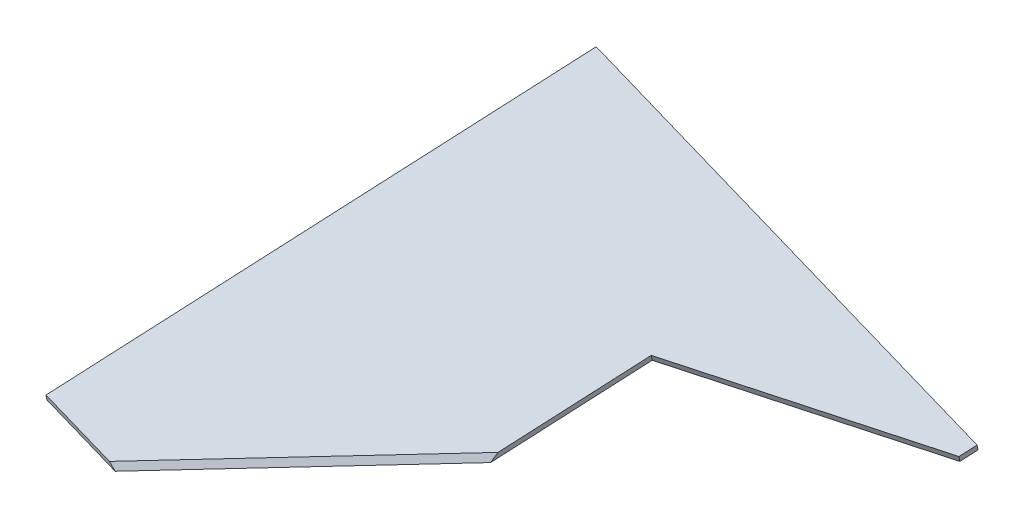
ISO-10303-21;
HEADER;
FILE_DESCRIPTION(('STEP AP214'),'2;1');
FILE_NAME('part.step','',(''),(''),'','','');
FILE_SCHEMA(('AUTOMOTIVE_DESIGN { 1 0 10303 214 1 1 1 1 }'));
ENDSEC;
DATA;
#1=APPLICATION_CONTEXT('core data for automotive mechanical design processes');
#2=APPLICATION_PROTOCOL_DEFINITION('international standard','automotive_design',2000,#1);
#3=PRODUCT_CONTEXT('',#1,'mechanical');
#4=PRODUCT('Part','Part','',(#3));
#5=PRODUCT_RELATED_PRODUCT_CATEGORY('part','',(#4));
#6=PRODUCT_DEFINITION_FORMATION('','',#4);
#7=PRODUCT_DEFINITION_CONTEXT('part definition',#1,'design');
#8=PRODUCT_DEFINITION('design','',#6,#7);
#9=PRODUCT_DEFINITION_SHAPE('','',#8);
#10=(LENGTH_UNIT() NAMED_UNIT(*) SI_UNIT(.MILLI.,.METRE.));
#11=(NAMED_UNIT(*) PLANE_ANGLE_UNIT() SI_UNIT($,.RADIAN.));
#12=(NAMED_UNIT(*) SI_UNIT($,.STERADIAN.) SOLID_ANGLE_UNIT());
#13=UNCERTAINTY_MEASURE_WITH_UNIT(LENGTH_MEASURE(1.E-05),#10,'distance_accuracy_value','');
#14=(GEOMETRIC_REPRESENTATION_CONTEXT(3) GLOBAL_UNCERTAINTY_ASSIGNED_CONTEXT((#13)) GLOBAL_UNIT_ASSIGNED_CONTEXT((#10,
#11,#12)) REPRESENTATION_CONTEXT('',''));
#15=CARTESIAN_POINT('',(0.,0.,0.));
#16=DIRECTION('',(0.,0.,1.));
#17=DIRECTION('',(1.,0.,0.));
#18=AXIS2_PLACEMENT_3D('',#15,#16,#17);
#19=CARTESIAN_POINT('',(-33.7903082011656,364.512306045971,252.100637317166));
#20=DIRECTION('',(-0.97245536084359,0.169146641830464,-0.160374513947948));
#21=DIRECTION('',(-0.171364746471442,-0.985207655099562,0.));
#22=AXIS2_PLACEMENT_3D('',#19,#20,#21);
#23=PLANE('',#22);
#24=DIRECTION('',(0.200452709124791,0.255754847030097,-0.945731552622172));
#25=VECTOR('',#24,1.);
#26=CARTESIAN_POINT('',(-34.1471604719162,361.656818373786,251.252789093214));
#27=LINE('',#26,#25);
#28=CARTESIAN_POINT('',(-34.1471604719162,361.656818373786,251.252789093214));
#29=VERTEX_POINT('',#28);
#30=CARTESIAN_POINT('',(16.6532138889619,426.4723154078,11.5777199566262));
#31=VERTEX_POINT('',#30);
#32=EDGE_CURVE('E134',#29,#31,#27,.T.);
#33=ORIENTED_EDGE('',*,*,#32,.F.);
#34=DIRECTION('',(-0.118950756916867,-0.9518292240618,-0.282616074650427));
#35=VECTOR('',#34,1.);
#36=CARTESIAN_POINT('',(-33.7903082011656,364.512306045971,252.100637317166));
#37=LINE('',#36,#35);
#38=CARTESIAN_POINT('',(-33.7903082011656,364.512306045971,252.100637317166));
#39=VERTEX_POINT('',#38);
#40=EDGE_CURVE('E40',#39,#29,#37,.T.);
#41=ORIENTED_EDGE('',*,*,#40,.F.);
#42=DIRECTION('',(0.200452709124791,0.255754847030097,-0.945731552622172));
#43=VECTOR('',#42,1.);
#44=CARTESIAN_POINT('',(-33.7903082011656,364.512306045971,252.100637317166));
#45=LINE('',#44,#43);
#46=CARTESIAN_POINT('',(17.0100661597125,429.327803079985,12.4255681805774));
#47=VERTEX_POINT('',#46);
#48=EDGE_CURVE('E103',#39,#47,#45,.T.);
#49=ORIENTED_EDGE('',*,*,#48,.T.);
#50=DIRECTION('',(-0.118950756916867,-0.9518292240618,-0.282616074650427));
#51=VECTOR('',#50,1.);
#52=CARTESIAN_POINT('',(17.0100661597125,429.327803079985,12.4255681805774));
#53=LINE('',#52,#51);
#54=EDGE_CURVE('E97',#47,#31,#53,.T.);
#55=ORIENTED_EDGE('',*,*,#54,.T.);
#56=EDGE_LOOP('',(#33,#41,#49,#55));
#57=FACE_BOUND('',#56,.T.);
#58=ADVANCED_FACE('F33',(#57),#23,.T.);
#59=CARTESIAN_POINT('',(-33.7903082011656,364.512306045971,252.100637317166));
#60=DIRECTION('',(-0.200452709124791,-0.255754847030097,0.945731552622172));
#61=DIRECTION('',(0.,-0.965324375324192,-0.261053347814119));
#62=AXIS2_PLACEMENT_3D('',#59,#60,#61);
#63=PLANE('',#62);
#64=DIRECTION('',(0.615073227817233,-0.784224664521137,-0.081710464318843));
#65=VECTOR('',#64,1.);
#66=CARTESIAN_POINT('',(-11.8843363994602,380.751963847055,261.135423739073));
#67=LINE('',#66,#65);
#68=CARTESIAN_POINT('',(6.32511948565873,357.534721107848,258.716357149804));
#69=VERTEX_POINT('',#68);
#70=CARTESIAN_POINT('',(8.9748610828492,354.156273435042,258.364347654935));
#71=VERTEX_POINT('',#70);
#72=EDGE_CURVE('E54',#69,#71,#67,.T.);
#73=ORIENTED_EDGE('',*,*,#72,.F.);
#74=DIRECTION('',(-0.97245536084359,0.169146641830464,-0.160374513947948));
#75=VECTOR('',#74,1.);
#76=CARTESIAN_POINT('',(-33.7903082011656,364.512306045971,252.100637317166));
#77=LINE('',#76,#75);
#78=EDGE_CURVE('E138',#69,#39,#77,.T.);
#79=ORIENTED_EDGE('',*,*,#78,.T.);
#80=ORIENTED_EDGE('',*,*,#40,.T.);
#81=DIRECTION('',(-0.97245536084359,0.169146641830464,-0.160374513947948));
#82=VECTOR('',#81,1.);
#83=CARTESIAN_POINT('',(-34.1471604719162,361.656818373786,251.252789093214));
#84=LINE('',#83,#82);
#85=EDGE_CURVE('E135',#71,#29,#84,.T.);
#86=ORIENTED_EDGE('',*,*,#85,.F.);
#87=EDGE_LOOP('',(#73,#79,#80,#86));
#88=FACE_BOUND('',#87,.T.);
#89=ADVANCED_FACE('F155',(#88),#63,.T.);
#90=CARTESIAN_POINT('',(95.5462547910566,342.015802682515,273.430447672247));
#91=DIRECTION('',(0.97245536084359,-0.169146641830464,0.160374513947948));
#92=DIRECTION('',(0.171364746471442,0.985207655099562,0.));
#93=AXIS2_PLACEMENT_3D('',#90,#91,#92);
#94=PLANE('',#93);
#95=DIRECTION('',(-0.118950756916867,-0.9518292240618,-0.282616074650427));
#96=VECTOR('',#95,1.);
#97=CARTESIAN_POINT('',(132.537914934905,389.212951689813,98.9045939950377));
#98=LINE('',#97,#96);
#99=CARTESIAN_POINT('',(132.537914934905,389.212951689813,98.9045939950377));
#100=VERTEX_POINT('',#99);
#101=CARTESIAN_POINT('',(132.181062664155,386.357464017628,98.0567457710864));
#102=VERTEX_POINT('',#101);
#103=EDGE_CURVE('E47',#100,#102,#98,.T.);
#104=ORIENTED_EDGE('',*,*,#103,.F.);
#105=DIRECTION('',(-0.200452709124791,-0.255754847030097,0.945731552622172));
#106=VECTOR('',#105,1.);
#107=CARTESIAN_POINT('',(95.5462547910566,342.015802682515,273.430447672247));
#108=LINE('',#107,#106);
#109=CARTESIAN_POINT('',(118.387318654633,371.15840105367,165.66680164542));
#110=VERTEX_POINT('',#109);
#111=EDGE_CURVE('E102',#100,#110,#108,.T.);
#112=ORIENTED_EDGE('',*,*,#111,.T.);
#113=DIRECTION('',(0.231192288874478,0.787542154090724,-0.571250804021423));
#114=VECTOR('',#113,1.);
#115=CARTESIAN_POINT('',(97.628153371008,300.443595537523,216.960423577262));
#116=LINE('',#115,#114);
#117=CARTESIAN_POINT('',(117.260763080799,367.320859552438,168.450396982708));
#118=VERTEX_POINT('',#117);
#119=EDGE_CURVE('E126',#118,#110,#116,.T.);
#120=ORIENTED_EDGE('',*,*,#119,.F.);
#121=DIRECTION('',(-0.200452709124791,-0.255754847030097,0.945731552622172));
#122=VECTOR('',#121,1.);
#123=CARTESIAN_POINT('',(95.189402520306,339.16031501033,272.582599448296));
#124=LINE('',#123,#122);
#125=EDGE_CURVE('E144',#102,#118,#124,.T.);
#126=ORIENTED_EDGE('',*,*,#125,.F.);
#127=EDGE_LOOP('',(#104,#112,#120,#126));
#128=FACE_BOUND('',#127,.T.);
#129=ADVANCED_FACE('F158',(#128),#94,.T.);
#130=CARTESIAN_POINT('',(17.0100661597125,429.327803079985,12.4255681805774));
#131=DIRECTION('',(0.200452709124791,0.255754847030097,-0.945731552622172));
#132=DIRECTION('',(0.,0.965324375324192,0.261053347814119));
#133=AXIS2_PLACEMENT_3D('',#130,#131,#132);
#134=PLANE('',#133);
#135=DIRECTION('',(0.97245536084359,-0.169146641830463,0.160374513947948));
#136=VECTOR('',#135,1.);
#137=CARTESIAN_POINT('',(16.6532138889619,426.4723154078,11.5777199566262));
#138=LINE('',#137,#136);
#139=CARTESIAN_POINT('',(257.433161233811,384.591606890581,51.2864496101342));
#140=VERTEX_POINT('',#139);
#141=EDGE_CURVE('E142',#31,#140,#138,.T.);
#142=ORIENTED_EDGE('',*,*,#141,.F.);
#143=ORIENTED_EDGE('',*,*,#54,.F.);
#144=DIRECTION('',(0.97245536084359,-0.169146641830463,0.160374513947948));
#145=VECTOR('',#144,1.);
#146=CARTESIAN_POINT('',(17.0100661597125,429.327803079985,12.4255681805774));
#147=LINE('',#146,#145);
#148=CARTESIAN_POINT('',(257.790013504561,387.447094562767,52.1342978340855));
#149=VERTEX_POINT('',#148);
#150=EDGE_CURVE('E91',#47,#149,#147,.T.);
#151=ORIENTED_EDGE('',*,*,#150,.T.);
#152=DIRECTION('',(-0.118950756916867,-0.9518292240618,-0.282616074650427));
#153=VECTOR('',#152,1.);
#154=CARTESIAN_POINT('',(257.790013504561,387.447094562767,52.1342978340855));
#155=LINE('',#154,#153);
#156=EDGE_CURVE('E95',#149,#140,#155,.T.);
#157=ORIENTED_EDGE('',*,*,#156,.T.);
#158=EDGE_LOOP('',(#142,#143,#151,#157));
#159=FACE_BOUND('',#158,.T.);
#160=ADVANCED_FACE('F94',(#159),#134,.T.);
#161=CARTESIAN_POINT('',(49.2672356639689,394.230317731218,117.05442750532));
#162=DIRECTION('',(-0.118950756916867,-0.9518292240618,-0.282616074650427));
#163=DIRECTION('',(0.,0.284636952950701,-0.958635386898971));
#164=AXIS2_PLACEMENT_3D('',#161,#162,#163);
#165=PLANE('',#164);
#166=ORIENTED_EDGE('',*,*,#78,.F.);
#167=DIRECTION('',(0.766009907789521,0.0931257274660205,-0.636047498267397));
#168=VECTOR('',#167,1.);
#169=CARTESIAN_POINT('',(103.160343585347,369.307219866567,178.310344895335));
#170=LINE('',#169,#168);
#171=EDGE_CURVE('E131',#69,#110,#170,.T.);
#172=ORIENTED_EDGE('',*,*,#171,.T.);
#173=ORIENTED_EDGE('',*,*,#111,.F.);
#174=DIRECTION('',(-0.953480406796191,0.0300966303353339,0.299948840134829));
#175=VECTOR('',#174,1.);
#176=CARTESIAN_POINT('',(256.116736436895,385.312183429122,60.028782902808));
#177=LINE('',#176,#175);
#178=CARTESIAN_POINT('',(256.116736436895,385.312183429122,60.028782902808));
#179=VERTEX_POINT('',#178);
#180=EDGE_CURVE('E117',#179,#100,#177,.T.);
#181=ORIENTED_EDGE('',*,*,#180,.F.);
#182=DIRECTION('',(-0.200452709124791,-0.255754847030095,0.945731552622172));
#183=VECTOR('',#182,1.);
#184=CARTESIAN_POINT('',(257.790013504561,387.447094562767,52.1342978340855));
#185=LINE('',#184,#183);
#186=EDGE_CURVE('E108',#149,#179,#185,.T.);
#187=ORIENTED_EDGE('',*,*,#186,.F.);
#188=ORIENTED_EDGE('',*,*,#150,.F.);
#189=ORIENTED_EDGE('',*,*,#48,.F.);
#190=EDGE_LOOP('',(#166,#172,#173,#181,#187,#188,#189));
#191=FACE_BOUND('',#190,.T.);
#192=ADVANCED_FACE('F115',(#191),#165,.F.);
#193=CARTESIAN_POINT('',(48.9103833932183,391.374830059033,116.206579281369));
#194=DIRECTION('',(-0.118950756916867,-0.9518292240618,-0.282616074650427));
#195=DIRECTION('',(0.,0.284636952950701,-0.958635386898971));
#196=AXIS2_PLACEMENT_3D('',#193,#194,#195);
#197=PLANE('',#196);
#198=DIRECTION('',(0.766009907789521,0.0931257274660205,-0.636047498267397));
#199=VECTOR('',#198,1.);
#200=CARTESIAN_POINT('',(104.324789920057,365.748201158826,179.19163320286));
#201=LINE('',#200,#199);
#202=EDGE_CURVE('E11',#71,#118,#201,.T.);
#203=ORIENTED_EDGE('',*,*,#202,.F.);
#204=ORIENTED_EDGE('',*,*,#85,.T.);
#205=ORIENTED_EDGE('',*,*,#32,.T.);
#206=ORIENTED_EDGE('',*,*,#141,.T.);
#207=DIRECTION('',(-0.200452709124791,-0.255754847030095,0.945731552622172));
#208=VECTOR('',#207,1.);
#209=CARTESIAN_POINT('',(257.433161233811,384.591606890581,51.2864496101342));
#210=LINE('',#209,#208);
#211=CARTESIAN_POINT('',(255.759884166145,382.456695756936,59.1809346788567));
#212=VERTEX_POINT('',#211);
#213=EDGE_CURVE('E110',#140,#212,#210,.T.);
#214=ORIENTED_EDGE('',*,*,#213,.T.);
#215=DIRECTION('',(-0.953480406796191,0.0300966303353339,0.299948840134829));
#216=VECTOR('',#215,1.);
#217=CARTESIAN_POINT('',(255.759884166145,382.456695756936,59.1809346788567));
#218=LINE('',#217,#216);
#219=EDGE_CURVE('E122',#212,#102,#218,.T.);
#220=ORIENTED_EDGE('',*,*,#219,.T.);
#221=ORIENTED_EDGE('',*,*,#125,.T.);
#222=EDGE_LOOP('',(#203,#204,#205,#206,#214,#220,#221));
#223=FACE_BOUND('',#222,.T.);
#224=ADVANCED_FACE('F152',(#223),#197,.T.);
#225=CARTESIAN_POINT('',(184.76274143836,119.897305559363,240.069514854651));
#226=DIRECTION('',(-0.567103813669204,-0.368008282958179,-0.736860345110264));
#227=DIRECTION('',(-0.792474193368697,0.,0.609905445823067));
#228=AXIS2_PLACEMENT_3D('',#225,#226,#227);
#229=PLANE('',#228);
#230=ORIENTED_EDGE('',*,*,#72,.T.);
#231=ORIENTED_EDGE('',*,*,#202,.T.);
#232=ORIENTED_EDGE('',*,*,#119,.T.);
#233=ORIENTED_EDGE('',*,*,#171,.F.);
#234=EDGE_LOOP('',(#230,#231,#232,#233));
#235=FACE_BOUND('',#234,.T.);
#236=ADVANCED_FACE('F156',(#235),#229,.F.);
#237=CARTESIAN_POINT('',(256.116736436895,385.312183429122,60.028782902808));
#238=DIRECTION('',(0.276994280238194,-0.305148031395206,0.911130532717983));
#239=DIRECTION('',(0.,-0.948233420354474,-0.317574212622586));
#240=AXIS2_PLACEMENT_3D('',#237,#238,#239);
#241=PLANE('',#240);
#242=ORIENTED_EDGE('',*,*,#219,.F.);
#243=DIRECTION('',(-0.118950756916867,-0.9518292240618,-0.282616074650427));
#244=VECTOR('',#243,1.);
#245=CARTESIAN_POINT('',(256.116736436895,385.312183429122,60.028782902808));
#246=LINE('',#245,#244);
#247=EDGE_CURVE('E111',#179,#212,#246,.T.);
#248=ORIENTED_EDGE('',*,*,#247,.F.);
#249=ORIENTED_EDGE('',*,*,#180,.T.);
#250=ORIENTED_EDGE('',*,*,#103,.T.);
#251=EDGE_LOOP('',(#242,#248,#249,#250));
#252=FACE_BOUND('',#251,.T.);
#253=ADVANCED_FACE('F161',(#252),#241,.T.);
#254=CARTESIAN_POINT('',(257.790013504561,387.447094562767,52.1342978340855));
#255=DIRECTION('',(0.97245536084359,-0.169146641830464,0.160374513947948));
#256=DIRECTION('',(0.171364746471442,0.985207655099562,0.));
#257=AXIS2_PLACEMENT_3D('',#254,#255,#256);
#258=PLANE('',#257);
#259=ORIENTED_EDGE('',*,*,#213,.F.);
#260=ORIENTED_EDGE('',*,*,#156,.F.);
#261=ORIENTED_EDGE('',*,*,#186,.T.);
#262=ORIENTED_EDGE('',*,*,#247,.T.);
#263=EDGE_LOOP('',(#259,#260,#261,#262));
#264=FACE_BOUND('',#263,.T.);
#265=ADVANCED_FACE('F107',(#264),#258,.T.);
#266=CLOSED_SHELL('',(#58,#89,#129,#160,#192,#224,#236,#253,#265));
#267=MANIFOLD_SOLID_BREP('B2',#266);
#268=ADVANCED_BREP_SHAPE_REPRESENTATION('',(#18,#267),#14);
#269=SHAPE_DEFINITION_REPRESENTATION(#9,#268);
ENDSEC;
END-ISO-10303-21;
